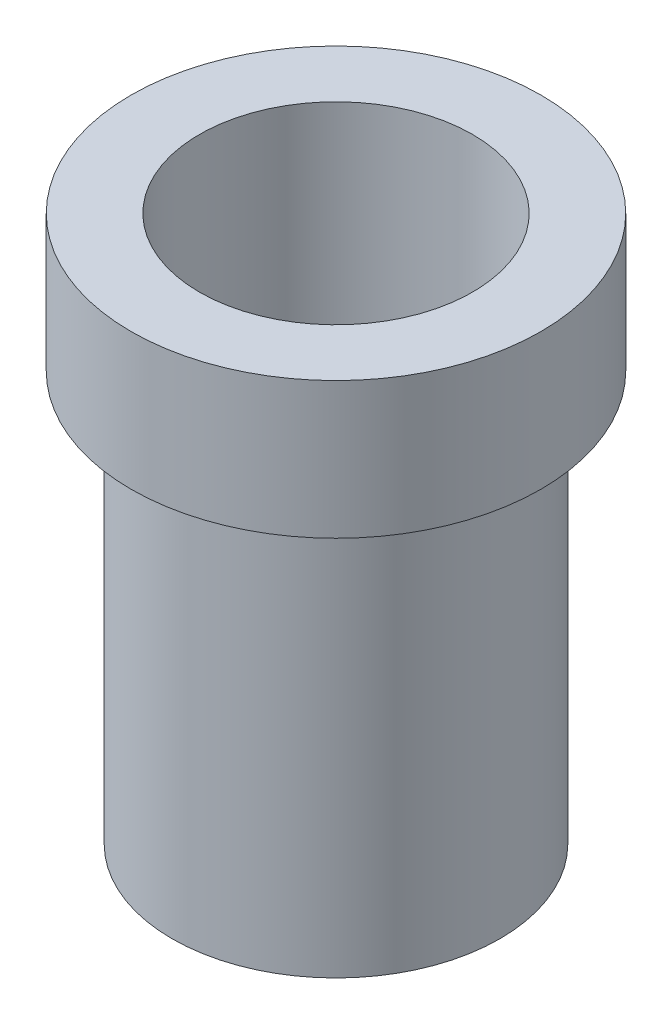
ISO-10303-21;
HEADER;
FILE_DESCRIPTION(('STEP AP214'),'2;1');
FILE_NAME('part.step','',(''),(''),'','','');
FILE_SCHEMA(('AUTOMOTIVE_DESIGN { 1 0 10303 214 1 1 1 1 }'));
ENDSEC;
DATA;
#1=APPLICATION_CONTEXT('core data for automotive mechanical design processes');
#2=APPLICATION_PROTOCOL_DEFINITION('international standard','automotive_design',2000,#1);
#3=PRODUCT_CONTEXT('',#1,'mechanical');
#4=PRODUCT('Part','Part','',(#3));
#5=PRODUCT_RELATED_PRODUCT_CATEGORY('part','',(#4));
#6=PRODUCT_DEFINITION_FORMATION('','',#4);
#7=PRODUCT_DEFINITION_CONTEXT('part definition',#1,'design');
#8=PRODUCT_DEFINITION('design','',#6,#7);
#9=PRODUCT_DEFINITION_SHAPE('','',#8);
#10=(LENGTH_UNIT() NAMED_UNIT(*) SI_UNIT(.MILLI.,.METRE.));
#11=(NAMED_UNIT(*) PLANE_ANGLE_UNIT() SI_UNIT($,.RADIAN.));
#12=(NAMED_UNIT(*) SI_UNIT($,.STERADIAN.) SOLID_ANGLE_UNIT());
#13=UNCERTAINTY_MEASURE_WITH_UNIT(LENGTH_MEASURE(1.E-05),#10,'distance_accuracy_value','');
#14=(GEOMETRIC_REPRESENTATION_CONTEXT(3) GLOBAL_UNCERTAINTY_ASSIGNED_CONTEXT((#13)) GLOBAL_UNIT_ASSIGNED_CONTEXT((#10,
#11,#12)) REPRESENTATION_CONTEXT('',''));
#15=CARTESIAN_POINT('',(0.,0.,0.));
#16=DIRECTION('',(0.,0.,1.));
#17=DIRECTION('',(1.,0.,0.));
#18=AXIS2_PLACEMENT_3D('',#15,#16,#17);
#19=CARTESIAN_POINT('',(0.,0.,0.));
#20=DIRECTION('',(0.,1.,0.));
#21=DIRECTION('',(0.,0.,1.));
#22=AXIS2_PLACEMENT_3D('',#19,#20,#21);
#23=PLANE('',#22);
#24=CARTESIAN_POINT('',(0.,0.,0.));
#25=DIRECTION('',(0.,1.,0.));
#26=DIRECTION('',(0.,0.,1.));
#27=AXIS2_PLACEMENT_3D('',#24,#25,#26);
#28=CIRCLE('',#27,7.5);
#29=CARTESIAN_POINT('',(0.,0.,7.5));
#30=VERTEX_POINT('',#29);
#31=EDGE_CURVE('E42',#30,#30,#28,.T.);
#32=ORIENTED_EDGE('',*,*,#31,.F.);
#33=EDGE_LOOP('',(#32));
#34=FACE_BOUND('',#33,.T.);
#35=CARTESIAN_POINT('',(0.,0.,0.));
#36=DIRECTION('',(0.,1.,0.));
#37=DIRECTION('',(0.,0.,1.));
#38=AXIS2_PLACEMENT_3D('',#35,#36,#37);
#39=CIRCLE('',#38,6.);
#40=CARTESIAN_POINT('',(0.,0.,6.));
#41=VERTEX_POINT('',#40);
#42=EDGE_CURVE('E10',#41,#41,#39,.F.);
#43=ORIENTED_EDGE('',*,*,#42,.F.);
#44=EDGE_LOOP('',(#43));
#45=FACE_BOUND('',#44,.T.);
#46=ADVANCED_FACE('F31',(#34,#45),#23,.F.);
#47=CARTESIAN_POINT('',(0.,5.,0.));
#48=DIRECTION('',(0.,-1.,0.));
#49=DIRECTION('',(0.,0.,-1.));
#50=AXIS2_PLACEMENT_3D('',#47,#48,#49);
#51=CYLINDRICAL_SURFACE('',#50,7.5);
#52=CARTESIAN_POINT('',(0.,5.,0.));
#53=DIRECTION('',(0.,1.,0.));
#54=DIRECTION('',(0.,0.,1.));
#55=AXIS2_PLACEMENT_3D('',#52,#53,#54);
#56=CIRCLE('',#55,7.5);
#57=CARTESIAN_POINT('',(0.,5.,7.5));
#58=VERTEX_POINT('',#57);
#59=EDGE_CURVE('E38',#58,#58,#56,.T.);
#60=ORIENTED_EDGE('',*,*,#59,.F.);
#61=EDGE_LOOP('',(#60));
#62=FACE_BOUND('',#61,.T.);
#63=ORIENTED_EDGE('',*,*,#31,.T.);
#64=EDGE_LOOP('',(#63));
#65=FACE_BOUND('',#64,.T.);
#66=ADVANCED_FACE('F33',(#62,#65),#51,.T.);
#67=CARTESIAN_POINT('',(0.,5.,0.));
#68=DIRECTION('',(0.,1.,0.));
#69=DIRECTION('',(0.,0.,1.));
#70=AXIS2_PLACEMENT_3D('',#67,#68,#69);
#71=PLANE('',#70);
#72=CARTESIAN_POINT('',(0.,5.,0.));
#73=DIRECTION('',(0.,1.,0.));
#74=DIRECTION('',(0.,0.,1.));
#75=AXIS2_PLACEMENT_3D('',#72,#73,#74);
#76=CIRCLE('',#75,5.);
#77=CARTESIAN_POINT('',(0.,5.,5.));
#78=VERTEX_POINT('',#77);
#79=EDGE_CURVE('E51',#78,#78,#76,.T.);
#80=ORIENTED_EDGE('',*,*,#79,.F.);
#81=EDGE_LOOP('',(#80));
#82=FACE_BOUND('',#81,.T.);
#83=ORIENTED_EDGE('',*,*,#59,.T.);
#84=EDGE_LOOP('',(#83));
#85=FACE_BOUND('',#84,.T.);
#86=ADVANCED_FACE('F60',(#82,#85),#71,.T.);
#87=CARTESIAN_POINT('',(0.,-15.,0.));
#88=DIRECTION('',(0.,1.,0.));
#89=DIRECTION('',(0.,0.,1.));
#90=AXIS2_PLACEMENT_3D('',#87,#88,#89);
#91=CYLINDRICAL_SURFACE('',#90,6.);
#92=CARTESIAN_POINT('',(0.,-15.,0.));
#93=DIRECTION('',(0.,-1.,0.));
#94=DIRECTION('',(0.,0.,-1.));
#95=AXIS2_PLACEMENT_3D('',#92,#93,#94);
#96=CIRCLE('',#95,6.);
#97=CARTESIAN_POINT('',(0.,-15.,-6.));
#98=VERTEX_POINT('',#97);
#99=EDGE_CURVE('E47',#98,#98,#96,.T.);
#100=ORIENTED_EDGE('',*,*,#99,.F.);
#101=EDGE_LOOP('',(#100));
#102=FACE_BOUND('',#101,.T.);
#103=ORIENTED_EDGE('',*,*,#42,.T.);
#104=EDGE_LOOP('',(#103));
#105=FACE_BOUND('',#104,.T.);
#106=ADVANCED_FACE('F62',(#102,#105),#91,.T.);
#107=CARTESIAN_POINT('',(0.,-15.,0.));
#108=DIRECTION('',(0.,-1.,0.));
#109=DIRECTION('',(0.,0.,-1.));
#110=AXIS2_PLACEMENT_3D('',#107,#108,#109);
#111=PLANE('',#110);
#112=CARTESIAN_POINT('',(0.,-15.,0.));
#113=DIRECTION('',(0.,-1.,0.));
#114=DIRECTION('',(0.,0.,-1.));
#115=AXIS2_PLACEMENT_3D('',#112,#113,#114);
#116=CIRCLE('',#115,5.);
#117=CARTESIAN_POINT('',(0.,-15.,-5.));
#118=VERTEX_POINT('',#117);
#119=EDGE_CURVE('E52',#118,#118,#116,.F.);
#120=ORIENTED_EDGE('',*,*,#119,.T.);
#121=EDGE_LOOP('',(#120));
#122=FACE_BOUND('',#121,.T.);
#123=ORIENTED_EDGE('',*,*,#99,.T.);
#124=EDGE_LOOP('',(#123));
#125=FACE_BOUND('',#124,.T.);
#126=ADVANCED_FACE('F68',(#122,#125),#111,.T.);
#127=CARTESIAN_POINT('',(0.,-15.001,0.));
#128=DIRECTION('',(0.,1.,0.));
#129=DIRECTION('',(0.,0.,1.));
#130=AXIS2_PLACEMENT_3D('',#127,#128,#129);
#131=CYLINDRICAL_SURFACE('',#130,5.);
#132=ORIENTED_EDGE('',*,*,#119,.F.);
#133=EDGE_LOOP('',(#132));
#134=FACE_BOUND('',#133,.T.);
#135=ORIENTED_EDGE('',*,*,#79,.T.);
#136=EDGE_LOOP('',(#135));
#137=FACE_BOUND('',#136,.T.);
#138=ADVANCED_FACE('F58',(#134,#137),#131,.F.);
#139=CLOSED_SHELL('',(#46,#66,#86,#106,#126,#138));
#140=MANIFOLD_SOLID_BREP('B2',#139);
#141=ADVANCED_BREP_SHAPE_REPRESENTATION('',(#18,#140),#14);
#142=SHAPE_DEFINITION_REPRESENTATION(#9,#141);
ENDSEC;
END-ISO-10303-21;
